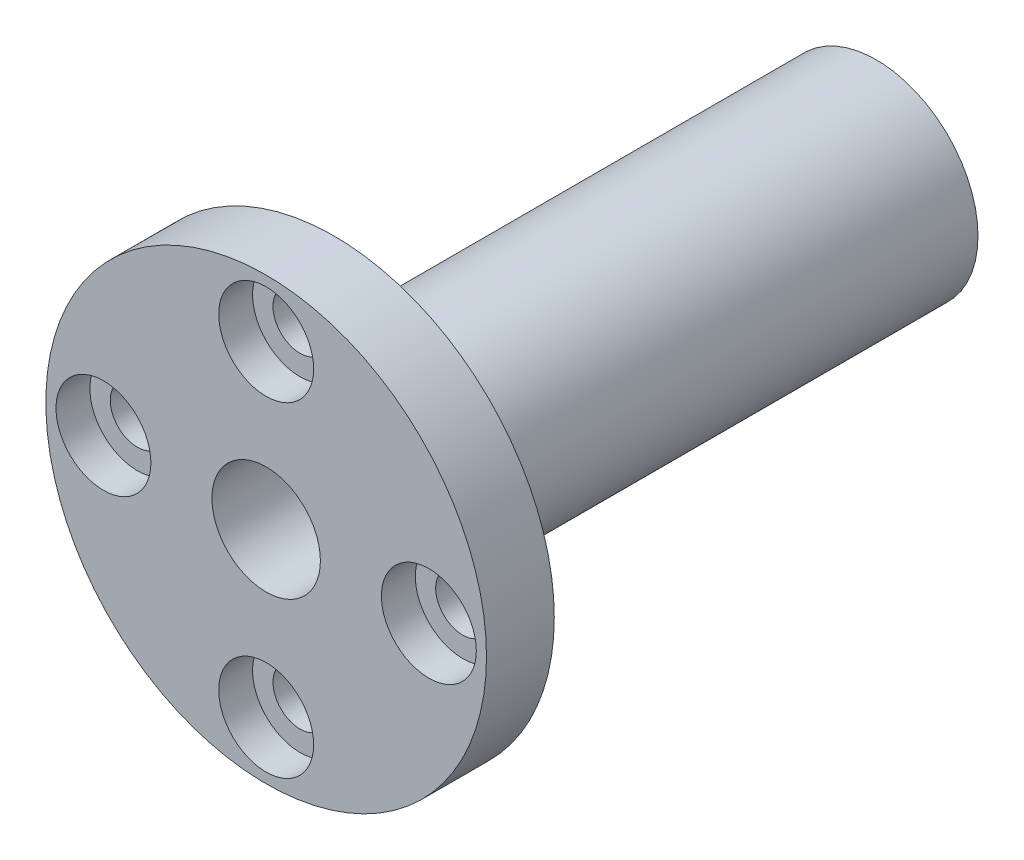
ISO-10303-21;
HEADER;
FILE_DESCRIPTION(('STEP AP214'),'2;1');
FILE_NAME('part.step','',(''),(''),'','','');
FILE_SCHEMA(('AUTOMOTIVE_DESIGN { 1 0 10303 214 1 1 1 1 }'));
ENDSEC;
DATA;
#1=APPLICATION_CONTEXT('core data for automotive mechanical design processes');
#2=APPLICATION_PROTOCOL_DEFINITION('international standard','automotive_design',2000,#1);
#3=PRODUCT_CONTEXT('',#1,'mechanical');
#4=PRODUCT('Part','Part','',(#3));
#5=PRODUCT_RELATED_PRODUCT_CATEGORY('part','',(#4));
#6=PRODUCT_DEFINITION_FORMATION('','',#4);
#7=PRODUCT_DEFINITION_CONTEXT('part definition',#1,'design');
#8=PRODUCT_DEFINITION('design','',#6,#7);
#9=PRODUCT_DEFINITION_SHAPE('','',#8);
#10=(LENGTH_UNIT() NAMED_UNIT(*) SI_UNIT(.MILLI.,.METRE.));
#11=(NAMED_UNIT(*) PLANE_ANGLE_UNIT() SI_UNIT($,.RADIAN.));
#12=(NAMED_UNIT(*) SI_UNIT($,.STERADIAN.) SOLID_ANGLE_UNIT());
#13=UNCERTAINTY_MEASURE_WITH_UNIT(LENGTH_MEASURE(1.E-05),#10,'distance_accuracy_value','');
#14=(GEOMETRIC_REPRESENTATION_CONTEXT(3) GLOBAL_UNCERTAINTY_ASSIGNED_CONTEXT((#13)) GLOBAL_UNIT_ASSIGNED_CONTEXT((#10,
#11,#12)) REPRESENTATION_CONTEXT('',''));
#15=CARTESIAN_POINT('',(0.,0.,0.));
#16=DIRECTION('',(0.,0.,1.));
#17=DIRECTION('',(1.,0.,0.));
#18=AXIS2_PLACEMENT_3D('',#15,#16,#17);
#19=CARTESIAN_POINT('',(0.,0.,5.));
#20=DIRECTION('',(0.,0.,-1.));
#21=DIRECTION('',(-1.,0.,0.));
#22=AXIS2_PLACEMENT_3D('',#19,#20,#21);
#23=CYLINDRICAL_SURFACE('',#22,16.25);
#24=CARTESIAN_POINT('',(0.,0.,5.));
#25=DIRECTION('',(0.,0.,1.));
#26=DIRECTION('',(1.,0.,0.));
#27=AXIS2_PLACEMENT_3D('',#24,#25,#26);
#28=CIRCLE('',#27,16.25);
#29=CARTESIAN_POINT('',(16.25,0.,5.));
#30=VERTEX_POINT('',#29);
#31=EDGE_CURVE('E42',#30,#30,#28,.T.);
#32=ORIENTED_EDGE('',*,*,#31,.F.);
#33=EDGE_LOOP('',(#32));
#34=FACE_BOUND('',#33,.T.);
#35=CARTESIAN_POINT('',(0.,0.,0.));
#36=DIRECTION('',(0.,0.,1.));
#37=DIRECTION('',(1.,0.,0.));
#38=AXIS2_PLACEMENT_3D('',#35,#36,#37);
#39=CIRCLE('',#38,16.25);
#40=CARTESIAN_POINT('',(16.25,0.,0.));
#41=VERTEX_POINT('',#40);
#42=EDGE_CURVE('E47',#41,#41,#39,.T.);
#43=ORIENTED_EDGE('',*,*,#42,.T.);
#44=EDGE_LOOP('',(#43));
#45=FACE_BOUND('',#44,.T.);
#46=ADVANCED_FACE('F35',(#34,#45),#23,.T.);
#47=CARTESIAN_POINT('',(0.,0.,5.));
#48=DIRECTION('',(0.,0.,1.));
#49=DIRECTION('',(1.,0.,0.));
#50=AXIS2_PLACEMENT_3D('',#47,#48,#49);
#51=PLANE('',#50);
#52=CARTESIAN_POINT('',(0.,0.,5.));
#53=DIRECTION('',(0.,0.,1.));
#54=DIRECTION('',(1.,0.,0.));
#55=AXIS2_PLACEMENT_3D('',#52,#53,#54);
#56=CIRCLE('',#55,4.);
#57=CARTESIAN_POINT('',(4.,0.,5.));
#58=VERTEX_POINT('',#57);
#59=EDGE_CURVE('E90',#58,#58,#56,.T.);
#60=ORIENTED_EDGE('',*,*,#59,.F.);
#61=EDGE_LOOP('',(#60));
#62=FACE_BOUND('',#61,.T.);
#63=CARTESIAN_POINT('',(0.,12.,5.));
#64=DIRECTION('',(0.,0.,1.));
#65=DIRECTION('',(1.,0.,0.));
#66=AXIS2_PLACEMENT_3D('',#63,#64,#65);
#67=CIRCLE('',#66,3.5);
#68=CARTESIAN_POINT('',(3.5,12.,5.));
#69=VERTEX_POINT('',#68);
#70=EDGE_CURVE('E56',#69,#69,#67,.T.);
#71=ORIENTED_EDGE('',*,*,#70,.F.);
#72=EDGE_LOOP('',(#71));
#73=FACE_BOUND('',#72,.T.);
#74=CARTESIAN_POINT('',(12.,0.,5.));
#75=DIRECTION('',(0.,0.,1.));
#76=DIRECTION('',(1.,0.,0.));
#77=AXIS2_PLACEMENT_3D('',#74,#75,#76);
#78=CIRCLE('',#77,3.5);
#79=CARTESIAN_POINT('',(15.5,0.,5.));
#80=VERTEX_POINT('',#79);
#81=EDGE_CURVE('E62',#80,#80,#78,.T.);
#82=ORIENTED_EDGE('',*,*,#81,.F.);
#83=EDGE_LOOP('',(#82));
#84=FACE_BOUND('',#83,.T.);
#85=CARTESIAN_POINT('',(0.,-12.,5.));
#86=DIRECTION('',(0.,0.,1.));
#87=DIRECTION('',(1.,0.,0.));
#88=AXIS2_PLACEMENT_3D('',#85,#86,#87);
#89=CIRCLE('',#88,3.5);
#90=CARTESIAN_POINT('',(3.5,-12.,5.));
#91=VERTEX_POINT('',#90);
#92=EDGE_CURVE('E68',#91,#91,#89,.T.);
#93=ORIENTED_EDGE('',*,*,#92,.F.);
#94=EDGE_LOOP('',(#93));
#95=FACE_BOUND('',#94,.T.);
#96=CARTESIAN_POINT('',(-12.,0.,5.));
#97=DIRECTION('',(0.,0.,1.));
#98=DIRECTION('',(1.,0.,0.));
#99=AXIS2_PLACEMENT_3D('',#96,#97,#98);
#100=CIRCLE('',#99,3.5);
#101=CARTESIAN_POINT('',(-8.5,0.,5.));
#102=VERTEX_POINT('',#101);
#103=EDGE_CURVE('E74',#102,#102,#100,.T.);
#104=ORIENTED_EDGE('',*,*,#103,.F.);
#105=EDGE_LOOP('',(#104));
#106=FACE_BOUND('',#105,.T.);
#107=ORIENTED_EDGE('',*,*,#31,.T.);
#108=EDGE_LOOP('',(#107));
#109=FACE_BOUND('',#108,.T.);
#110=ADVANCED_FACE('F129',(#62,#73,#84,#95,#106,#109),#51,.T.);
#111=CARTESIAN_POINT('',(0.,0.,0.));
#112=DIRECTION('',(0.,0.,1.));
#113=DIRECTION('',(1.,0.,0.));
#114=AXIS2_PLACEMENT_3D('',#111,#112,#113);
#115=PLANE('',#114);
#116=CARTESIAN_POINT('',(12.,0.,0.));
#117=DIRECTION('',(0.,0.,1.));
#118=DIRECTION('',(1.,0.,0.));
#119=AXIS2_PLACEMENT_3D('',#116,#117,#118);
#120=CIRCLE('',#119,2.);
#121=CARTESIAN_POINT('',(14.,0.,0.));
#122=VERTEX_POINT('',#121);
#123=EDGE_CURVE('E38',#122,#122,#120,.T.);
#124=ORIENTED_EDGE('',*,*,#123,.T.);
#125=EDGE_LOOP('',(#124));
#126=FACE_BOUND('',#125,.T.);
#127=CARTESIAN_POINT('',(0.,-12.,0.));
#128=DIRECTION('',(0.,0.,1.));
#129=DIRECTION('',(1.,0.,0.));
#130=AXIS2_PLACEMENT_3D('',#127,#128,#129);
#131=CIRCLE('',#130,2.);
#132=CARTESIAN_POINT('',(2.,-12.,0.));
#133=VERTEX_POINT('',#132);
#134=EDGE_CURVE('E85',#133,#133,#131,.T.);
#135=ORIENTED_EDGE('',*,*,#134,.T.);
#136=EDGE_LOOP('',(#135));
#137=FACE_BOUND('',#136,.T.);
#138=CARTESIAN_POINT('',(-12.,0.,0.));
#139=DIRECTION('',(0.,0.,1.));
#140=DIRECTION('',(1.,0.,0.));
#141=AXIS2_PLACEMENT_3D('',#138,#139,#140);
#142=CIRCLE('',#141,2.);
#143=CARTESIAN_POINT('',(-10.,0.,0.));
#144=VERTEX_POINT('',#143);
#145=EDGE_CURVE('E82',#144,#144,#142,.T.);
#146=ORIENTED_EDGE('',*,*,#145,.T.);
#147=EDGE_LOOP('',(#146));
#148=FACE_BOUND('',#147,.T.);
#149=CARTESIAN_POINT('',(0.,12.,0.));
#150=DIRECTION('',(0.,0.,1.));
#151=DIRECTION('',(1.,0.,0.));
#152=AXIS2_PLACEMENT_3D('',#149,#150,#151);
#153=CIRCLE('',#152,2.);
#154=CARTESIAN_POINT('',(2.,12.,0.));
#155=VERTEX_POINT('',#154);
#156=EDGE_CURVE('E79',#155,#155,#153,.T.);
#157=ORIENTED_EDGE('',*,*,#156,.T.);
#158=EDGE_LOOP('',(#157));
#159=FACE_BOUND('',#158,.T.);
#160=CARTESIAN_POINT('',(0.,0.,0.));
#161=DIRECTION('',(0.,0.,-1.));
#162=DIRECTION('',(-1.,0.,0.));
#163=AXIS2_PLACEMENT_3D('',#160,#161,#162);
#164=CIRCLE('',#163,7.5);
#165=CARTESIAN_POINT('',(-7.5,0.,0.));
#166=VERTEX_POINT('',#165);
#167=EDGE_CURVE('E10',#166,#166,#164,.T.);
#168=ORIENTED_EDGE('',*,*,#167,.F.);
#169=EDGE_LOOP('',(#168));
#170=FACE_BOUND('',#169,.T.);
#171=ORIENTED_EDGE('',*,*,#42,.F.);
#172=EDGE_LOOP('',(#171));
#173=FACE_BOUND('',#172,.T.);
#174=ADVANCED_FACE('F132',(#126,#137,#148,#159,#170,#173),#115,.F.);
#175=CARTESIAN_POINT('',(-12.,0.,2.5));
#176=DIRECTION('',(0.,0.,1.));
#177=DIRECTION('',(1.,0.,0.));
#178=AXIS2_PLACEMENT_3D('',#175,#176,#177);
#179=CYLINDRICAL_SURFACE('',#178,3.5);
#180=CARTESIAN_POINT('',(-12.,0.,2.5));
#181=DIRECTION('',(0.,0.,1.));
#182=DIRECTION('',(1.,0.,0.));
#183=AXIS2_PLACEMENT_3D('',#180,#181,#182);
#184=CIRCLE('',#183,3.5);
#185=CARTESIAN_POINT('',(-8.5,0.,2.5));
#186=VERTEX_POINT('',#185);
#187=EDGE_CURVE('E71',#186,#186,#184,.T.);
#188=ORIENTED_EDGE('',*,*,#187,.F.);
#189=EDGE_LOOP('',(#188));
#190=FACE_BOUND('',#189,.T.);
#191=ORIENTED_EDGE('',*,*,#103,.T.);
#192=EDGE_LOOP('',(#191));
#193=FACE_BOUND('',#192,.T.);
#194=ADVANCED_FACE('F146',(#190,#193),#179,.F.);
#195=CARTESIAN_POINT('',(-12.,0.,2.5));
#196=DIRECTION('',(0.,0.,1.));
#197=DIRECTION('',(1.,0.,0.));
#198=AXIS2_PLACEMENT_3D('',#195,#196,#197);
#199=PLANE('',#198);
#200=CARTESIAN_POINT('',(-12.,0.,2.5));
#201=DIRECTION('',(0.,0.,1.));
#202=DIRECTION('',(1.,0.,0.));
#203=AXIS2_PLACEMENT_3D('',#200,#201,#202);
#204=CIRCLE('',#203,2.);
#205=CARTESIAN_POINT('',(-10.,0.,2.5));
#206=VERTEX_POINT('',#205);
#207=EDGE_CURVE('E103',#206,#206,#204,.T.);
#208=ORIENTED_EDGE('',*,*,#207,.F.);
#209=EDGE_LOOP('',(#208));
#210=FACE_BOUND('',#209,.T.);
#211=ORIENTED_EDGE('',*,*,#187,.T.);
#212=EDGE_LOOP('',(#211));
#213=FACE_BOUND('',#212,.T.);
#214=ADVANCED_FACE('F150',(#210,#213),#199,.T.);
#215=CARTESIAN_POINT('',(0.,-12.,2.5));
#216=DIRECTION('',(0.,0.,1.));
#217=DIRECTION('',(1.,0.,0.));
#218=AXIS2_PLACEMENT_3D('',#215,#216,#217);
#219=CYLINDRICAL_SURFACE('',#218,3.5);
#220=CARTESIAN_POINT('',(0.,-12.,2.5));
#221=DIRECTION('',(0.,0.,1.));
#222=DIRECTION('',(1.,0.,0.));
#223=AXIS2_PLACEMENT_3D('',#220,#221,#222);
#224=CIRCLE('',#223,3.5);
#225=CARTESIAN_POINT('',(3.5,-12.,2.5));
#226=VERTEX_POINT('',#225);
#227=EDGE_CURVE('E65',#226,#226,#224,.T.);
#228=ORIENTED_EDGE('',*,*,#227,.F.);
#229=EDGE_LOOP('',(#228));
#230=FACE_BOUND('',#229,.T.);
#231=ORIENTED_EDGE('',*,*,#92,.T.);
#232=EDGE_LOOP('',(#231));
#233=FACE_BOUND('',#232,.T.);
#234=ADVANCED_FACE('F156',(#230,#233),#219,.F.);
#235=CARTESIAN_POINT('',(0.,-12.,2.5));
#236=DIRECTION('',(0.,0.,1.));
#237=DIRECTION('',(1.,0.,0.));
#238=AXIS2_PLACEMENT_3D('',#235,#236,#237);
#239=PLANE('',#238);
#240=CARTESIAN_POINT('',(0.,-12.,2.5));
#241=DIRECTION('',(0.,0.,1.));
#242=DIRECTION('',(1.,0.,0.));
#243=AXIS2_PLACEMENT_3D('',#240,#241,#242);
#244=CIRCLE('',#243,2.);
#245=CARTESIAN_POINT('',(2.,-12.,2.5));
#246=VERTEX_POINT('',#245);
#247=EDGE_CURVE('E106',#246,#246,#244,.T.);
#248=ORIENTED_EDGE('',*,*,#247,.F.);
#249=EDGE_LOOP('',(#248));
#250=FACE_BOUND('',#249,.T.);
#251=ORIENTED_EDGE('',*,*,#227,.T.);
#252=EDGE_LOOP('',(#251));
#253=FACE_BOUND('',#252,.T.);
#254=ADVANCED_FACE('F125',(#250,#253),#239,.T.);
#255=CARTESIAN_POINT('',(12.,0.,2.5));
#256=DIRECTION('',(0.,0.,1.));
#257=DIRECTION('',(1.,0.,0.));
#258=AXIS2_PLACEMENT_3D('',#255,#256,#257);
#259=CYLINDRICAL_SURFACE('',#258,3.5);
#260=CARTESIAN_POINT('',(12.,0.,2.5));
#261=DIRECTION('',(0.,0.,1.));
#262=DIRECTION('',(1.,0.,0.));
#263=AXIS2_PLACEMENT_3D('',#260,#261,#262);
#264=CIRCLE('',#263,3.5);
#265=CARTESIAN_POINT('',(15.5,0.,2.5));
#266=VERTEX_POINT('',#265);
#267=EDGE_CURVE('E59',#266,#266,#264,.T.);
#268=ORIENTED_EDGE('',*,*,#267,.F.);
#269=EDGE_LOOP('',(#268));
#270=FACE_BOUND('',#269,.T.);
#271=ORIENTED_EDGE('',*,*,#81,.T.);
#272=EDGE_LOOP('',(#271));
#273=FACE_BOUND('',#272,.T.);
#274=ADVANCED_FACE('F119',(#270,#273),#259,.F.);
#275=CARTESIAN_POINT('',(12.,0.,2.5));
#276=DIRECTION('',(0.,0.,1.));
#277=DIRECTION('',(1.,0.,0.));
#278=AXIS2_PLACEMENT_3D('',#275,#276,#277);
#279=PLANE('',#278);
#280=CARTESIAN_POINT('',(12.,0.,2.5));
#281=DIRECTION('',(0.,0.,1.));
#282=DIRECTION('',(1.,0.,0.));
#283=AXIS2_PLACEMENT_3D('',#280,#281,#282);
#284=CIRCLE('',#283,2.);
#285=CARTESIAN_POINT('',(14.,0.,2.5));
#286=VERTEX_POINT('',#285);
#287=EDGE_CURVE('E83',#286,#286,#284,.T.);
#288=ORIENTED_EDGE('',*,*,#287,.F.);
#289=EDGE_LOOP('',(#288));
#290=FACE_BOUND('',#289,.T.);
#291=ORIENTED_EDGE('',*,*,#267,.T.);
#292=EDGE_LOOP('',(#291));
#293=FACE_BOUND('',#292,.T.);
#294=ADVANCED_FACE('F115',(#290,#293),#279,.T.);
#295=CARTESIAN_POINT('',(0.,12.,2.5));
#296=DIRECTION('',(0.,0.,1.));
#297=DIRECTION('',(1.,0.,0.));
#298=AXIS2_PLACEMENT_3D('',#295,#296,#297);
#299=CYLINDRICAL_SURFACE('',#298,3.5);
#300=CARTESIAN_POINT('',(0.,12.,2.5));
#301=DIRECTION('',(0.,0.,1.));
#302=DIRECTION('',(1.,0.,0.));
#303=AXIS2_PLACEMENT_3D('',#300,#301,#302);
#304=CIRCLE('',#303,3.5);
#305=CARTESIAN_POINT('',(3.5,12.,2.5));
#306=VERTEX_POINT('',#305);
#307=EDGE_CURVE('E53',#306,#306,#304,.T.);
#308=ORIENTED_EDGE('',*,*,#307,.F.);
#309=EDGE_LOOP('',(#308));
#310=FACE_BOUND('',#309,.T.);
#311=ORIENTED_EDGE('',*,*,#70,.T.);
#312=EDGE_LOOP('',(#311));
#313=FACE_BOUND('',#312,.T.);
#314=ADVANCED_FACE('F118',(#310,#313),#299,.F.);
#315=CARTESIAN_POINT('',(0.,12.,2.5));
#316=DIRECTION('',(0.,0.,1.));
#317=DIRECTION('',(1.,0.,0.));
#318=AXIS2_PLACEMENT_3D('',#315,#316,#317);
#319=PLANE('',#318);
#320=CARTESIAN_POINT('',(0.,12.,2.5));
#321=DIRECTION('',(0.,0.,1.));
#322=DIRECTION('',(1.,0.,0.));
#323=AXIS2_PLACEMENT_3D('',#320,#321,#322);
#324=CIRCLE('',#323,2.);
#325=CARTESIAN_POINT('',(2.,12.,2.5));
#326=VERTEX_POINT('',#325);
#327=EDGE_CURVE('E100',#326,#326,#324,.T.);
#328=ORIENTED_EDGE('',*,*,#327,.F.);
#329=EDGE_LOOP('',(#328));
#330=FACE_BOUND('',#329,.T.);
#331=ORIENTED_EDGE('',*,*,#307,.T.);
#332=EDGE_LOOP('',(#331));
#333=FACE_BOUND('',#332,.T.);
#334=ADVANCED_FACE('F166',(#330,#333),#319,.T.);
#335=CARTESIAN_POINT('',(0.,0.,-40.));
#336=DIRECTION('',(0.,0.,1.));
#337=DIRECTION('',(1.,0.,0.));
#338=AXIS2_PLACEMENT_3D('',#335,#336,#337);
#339=CYLINDRICAL_SURFACE('',#338,7.5);
#340=CARTESIAN_POINT('',(0.,0.,-40.));
#341=DIRECTION('',(0.,0.,-1.));
#342=DIRECTION('',(-1.,0.,0.));
#343=AXIS2_PLACEMENT_3D('',#340,#341,#342);
#344=CIRCLE('',#343,7.5);
#345=CARTESIAN_POINT('',(-7.5,0.,-40.));
#346=VERTEX_POINT('',#345);
#347=EDGE_CURVE('E51',#346,#346,#344,.T.);
#348=ORIENTED_EDGE('',*,*,#347,.F.);
#349=EDGE_LOOP('',(#348));
#350=FACE_BOUND('',#349,.T.);
#351=ORIENTED_EDGE('',*,*,#167,.T.);
#352=EDGE_LOOP('',(#351));
#353=FACE_BOUND('',#352,.T.);
#354=ADVANCED_FACE('F170',(#350,#353),#339,.T.);
#355=CARTESIAN_POINT('',(0.,0.,-40.));
#356=DIRECTION('',(0.,0.,-1.));
#357=DIRECTION('',(-1.,0.,0.));
#358=AXIS2_PLACEMENT_3D('',#355,#356,#357);
#359=PLANE('',#358);
#360=CARTESIAN_POINT('',(0.,0.,-40.));
#361=DIRECTION('',(0.,0.,1.));
#362=DIRECTION('',(1.,0.,0.));
#363=AXIS2_PLACEMENT_3D('',#360,#361,#362);
#364=CIRCLE('',#363,4.);
#365=CARTESIAN_POINT('',(4.,0.,-40.));
#366=VERTEX_POINT('',#365);
#367=EDGE_CURVE('E94',#366,#366,#364,.T.);
#368=ORIENTED_EDGE('',*,*,#367,.T.);
#369=EDGE_LOOP('',(#368));
#370=FACE_BOUND('',#369,.T.);
#371=ORIENTED_EDGE('',*,*,#347,.T.);
#372=EDGE_LOOP('',(#371));
#373=FACE_BOUND('',#372,.T.);
#374=ADVANCED_FACE('F174',(#370,#373),#359,.T.);
#375=CARTESIAN_POINT('',(0.,0.,-40.));
#376=DIRECTION('',(0.,0.,1.));
#377=DIRECTION('',(1.,0.,0.));
#378=AXIS2_PLACEMENT_3D('',#375,#376,#377);
#379=CYLINDRICAL_SURFACE('',#378,4.);
#380=ORIENTED_EDGE('',*,*,#367,.F.);
#381=EDGE_LOOP('',(#380));
#382=FACE_BOUND('',#381,.T.);
#383=ORIENTED_EDGE('',*,*,#59,.T.);
#384=EDGE_LOOP('',(#383));
#385=FACE_BOUND('',#384,.T.);
#386=ADVANCED_FACE('F178',(#382,#385),#379,.F.);
#387=CARTESIAN_POINT('',(0.,12.,-40.));
#388=DIRECTION('',(0.,0.,1.));
#389=DIRECTION('',(1.,0.,0.));
#390=AXIS2_PLACEMENT_3D('',#387,#388,#389);
#391=CYLINDRICAL_SURFACE('',#390,2.);
#392=ORIENTED_EDGE('',*,*,#327,.T.);
#393=EDGE_LOOP('',(#392));
#394=FACE_BOUND('',#393,.T.);
#395=ORIENTED_EDGE('',*,*,#156,.F.);
#396=EDGE_LOOP('',(#395));
#397=FACE_BOUND('',#396,.T.);
#398=ADVANCED_FACE('F182',(#394,#397),#391,.F.);
#399=CARTESIAN_POINT('',(-12.,0.,-40.));
#400=DIRECTION('',(0.,0.,1.));
#401=DIRECTION('',(1.,0.,0.));
#402=AXIS2_PLACEMENT_3D('',#399,#400,#401);
#403=CYLINDRICAL_SURFACE('',#402,2.);
#404=ORIENTED_EDGE('',*,*,#207,.T.);
#405=EDGE_LOOP('',(#404));
#406=FACE_BOUND('',#405,.T.);
#407=ORIENTED_EDGE('',*,*,#145,.F.);
#408=EDGE_LOOP('',(#407));
#409=FACE_BOUND('',#408,.T.);
#410=ADVANCED_FACE('F186',(#406,#409),#403,.F.);
#411=CARTESIAN_POINT('',(0.,-12.,-40.));
#412=DIRECTION('',(0.,0.,1.));
#413=DIRECTION('',(1.,0.,0.));
#414=AXIS2_PLACEMENT_3D('',#411,#412,#413);
#415=CYLINDRICAL_SURFACE('',#414,2.);
#416=ORIENTED_EDGE('',*,*,#247,.T.);
#417=EDGE_LOOP('',(#416));
#418=FACE_BOUND('',#417,.T.);
#419=ORIENTED_EDGE('',*,*,#134,.F.);
#420=EDGE_LOOP('',(#419));
#421=FACE_BOUND('',#420,.T.);
#422=ADVANCED_FACE('F190',(#418,#421),#415,.F.);
#423=CARTESIAN_POINT('',(12.,0.,-40.));
#424=DIRECTION('',(0.,0.,1.));
#425=DIRECTION('',(1.,0.,0.));
#426=AXIS2_PLACEMENT_3D('',#423,#424,#425);
#427=CYLINDRICAL_SURFACE('',#426,2.);
#428=ORIENTED_EDGE('',*,*,#287,.T.);
#429=EDGE_LOOP('',(#428));
#430=FACE_BOUND('',#429,.T.);
#431=ORIENTED_EDGE('',*,*,#123,.F.);
#432=EDGE_LOOP('',(#431));
#433=FACE_BOUND('',#432,.T.);
#434=ADVANCED_FACE('F112',(#430,#433),#427,.F.);
#435=CLOSED_SHELL('',(#46,#110,#174,#194,#214,#234,#254,#274,#294,#314,#334,#354,#374,#386,#398,
#410,#422,#434));
#436=MANIFOLD_SOLID_BREP('B2',#435);
#437=ADVANCED_BREP_SHAPE_REPRESENTATION('',(#18,#436),#14);
#438=SHAPE_DEFINITION_REPRESENTATION(#9,#437);
ENDSEC;
END-ISO-10303-21;
